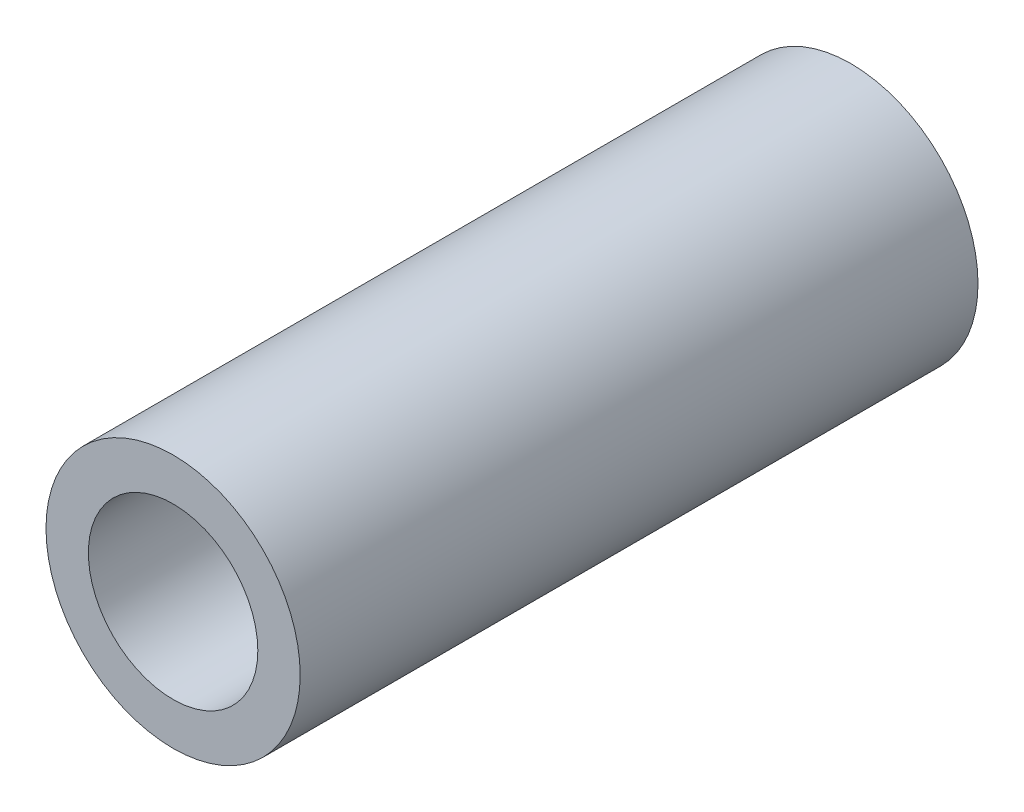
ISO-10303-21;
HEADER;
FILE_DESCRIPTION(('STEP AP214'),'2;1');
FILE_NAME('part.step','',(''),(''),'','','');
FILE_SCHEMA(('AUTOMOTIVE_DESIGN { 1 0 10303 214 1 1 1 1 }'));
ENDSEC;
DATA;
#1=APPLICATION_CONTEXT('core data for automotive mechanical design processes');
#2=APPLICATION_PROTOCOL_DEFINITION('international standard','automotive_design',2000,#1);
#3=PRODUCT_CONTEXT('',#1,'mechanical');
#4=PRODUCT('Part','Part','',(#3));
#5=PRODUCT_RELATED_PRODUCT_CATEGORY('part','',(#4));
#6=PRODUCT_DEFINITION_FORMATION('','',#4);
#7=PRODUCT_DEFINITION_CONTEXT('part definition',#1,'design');
#8=PRODUCT_DEFINITION('design','',#6,#7);
#9=PRODUCT_DEFINITION_SHAPE('','',#8);
#10=(LENGTH_UNIT() NAMED_UNIT(*) SI_UNIT(.MILLI.,.METRE.));
#11=(NAMED_UNIT(*) PLANE_ANGLE_UNIT() SI_UNIT($,.RADIAN.));
#12=(NAMED_UNIT(*) SI_UNIT($,.STERADIAN.) SOLID_ANGLE_UNIT());
#13=UNCERTAINTY_MEASURE_WITH_UNIT(LENGTH_MEASURE(1.E-05),#10,'distance_accuracy_value','');
#14=(GEOMETRIC_REPRESENTATION_CONTEXT(3) GLOBAL_UNCERTAINTY_ASSIGNED_CONTEXT((#13)) GLOBAL_UNIT_ASSIGNED_CONTEXT((#10,
#11,#12)) REPRESENTATION_CONTEXT('',''));
#15=CARTESIAN_POINT('',(0.,0.,0.));
#16=DIRECTION('',(0.,0.,1.));
#17=DIRECTION('',(1.,0.,0.));
#18=AXIS2_PLACEMENT_3D('',#15,#16,#17);
#19=CARTESIAN_POINT('',(0.,0.,-12.7));
#20=DIRECTION('',(0.,0.,1.));
#21=DIRECTION('',(-1.,0.,0.));
#22=AXIS2_PLACEMENT_3D('',#19,#20,#21);
#23=CYLINDRICAL_SURFACE('',#22,4.7625);
#24=CARTESIAN_POINT('',(0.,0.,-12.7));
#25=DIRECTION('',(0.,0.,1.));
#26=DIRECTION('',(1.,0.,0.));
#27=AXIS2_PLACEMENT_3D('',#24,#25,#26);
#28=CIRCLE('',#27,4.7625);
#29=CARTESIAN_POINT('',(4.7625,0.,-12.7));
#30=VERTEX_POINT('',#29);
#31=EDGE_CURVE('E10',#30,#30,#28,.T.);
#32=ORIENTED_EDGE('',*,*,#31,.T.);
#33=EDGE_LOOP('',(#32));
#34=FACE_BOUND('',#33,.T.);
#35=CARTESIAN_POINT('',(0.,0.,12.7));
#36=DIRECTION('',(0.,0.,1.));
#37=DIRECTION('',(1.,0.,0.));
#38=AXIS2_PLACEMENT_3D('',#35,#36,#37);
#39=CIRCLE('',#38,4.7625);
#40=CARTESIAN_POINT('',(4.7625,0.,12.7));
#41=VERTEX_POINT('',#40);
#42=EDGE_CURVE('E33',#41,#41,#39,.T.);
#43=ORIENTED_EDGE('',*,*,#42,.F.);
#44=EDGE_LOOP('',(#43));
#45=FACE_BOUND('',#44,.T.);
#46=ADVANCED_FACE('F30',(#34,#45),#23,.T.);
#47=CARTESIAN_POINT('',(0.,0.,-12.7));
#48=DIRECTION('',(0.,0.,-1.));
#49=DIRECTION('',(1.,0.,0.));
#50=AXIS2_PLACEMENT_3D('',#47,#48,#49);
#51=PLANE('',#50);
#52=CARTESIAN_POINT('',(0.,0.,-12.7));
#53=DIRECTION('',(0.,0.,1.));
#54=DIRECTION('',(1.,0.,0.));
#55=AXIS2_PLACEMENT_3D('',#52,#53,#54);
#56=CIRCLE('',#55,3.175);
#57=CARTESIAN_POINT('',(3.175,0.,-12.7));
#58=VERTEX_POINT('',#57);
#59=EDGE_CURVE('E42',#58,#58,#56,.T.);
#60=ORIENTED_EDGE('',*,*,#59,.T.);
#61=EDGE_LOOP('',(#60));
#62=FACE_BOUND('',#61,.T.);
#63=ORIENTED_EDGE('',*,*,#31,.F.);
#64=EDGE_LOOP('',(#63));
#65=FACE_BOUND('',#64,.T.);
#66=ADVANCED_FACE('F54',(#62,#65),#51,.T.);
#67=CARTESIAN_POINT('',(0.,0.,12.7));
#68=DIRECTION('',(0.,0.,-1.));
#69=DIRECTION('',(1.,0.,0.));
#70=AXIS2_PLACEMENT_3D('',#67,#68,#69);
#71=PLANE('',#70);
#72=CARTESIAN_POINT('',(0.,0.,12.7));
#73=DIRECTION('',(0.,0.,1.));
#74=DIRECTION('',(1.,0.,0.));
#75=AXIS2_PLACEMENT_3D('',#72,#73,#74);
#76=CIRCLE('',#75,3.175);
#77=CARTESIAN_POINT('',(3.175,0.,12.7));
#78=VERTEX_POINT('',#77);
#79=EDGE_CURVE('E40',#78,#78,#76,.T.);
#80=ORIENTED_EDGE('',*,*,#79,.F.);
#81=EDGE_LOOP('',(#80));
#82=FACE_BOUND('',#81,.T.);
#83=ORIENTED_EDGE('',*,*,#42,.T.);
#84=EDGE_LOOP('',(#83));
#85=FACE_BOUND('',#84,.T.);
#86=ADVANCED_FACE('F51',(#82,#85),#71,.F.);
#87=CARTESIAN_POINT('',(0.,0.,12.7));
#88=DIRECTION('',(0.,0.,-1.));
#89=DIRECTION('',(1.,0.,0.));
#90=AXIS2_PLACEMENT_3D('',#87,#88,#89);
#91=CYLINDRICAL_SURFACE('',#90,3.175);
#92=ORIENTED_EDGE('',*,*,#79,.T.);
#93=EDGE_LOOP('',(#92));
#94=FACE_BOUND('',#93,.T.);
#95=ORIENTED_EDGE('',*,*,#59,.F.);
#96=EDGE_LOOP('',(#95));
#97=FACE_BOUND('',#96,.T.);
#98=ADVANCED_FACE('F48',(#94,#97),#91,.F.);
#99=CLOSED_SHELL('',(#46,#66,#86,#98));
#100=MANIFOLD_SOLID_BREP('B2',#99);
#101=ADVANCED_BREP_SHAPE_REPRESENTATION('',(#18,#100),#14);
#102=SHAPE_DEFINITION_REPRESENTATION(#9,#101);
ENDSEC;
END-ISO-10303-21;
